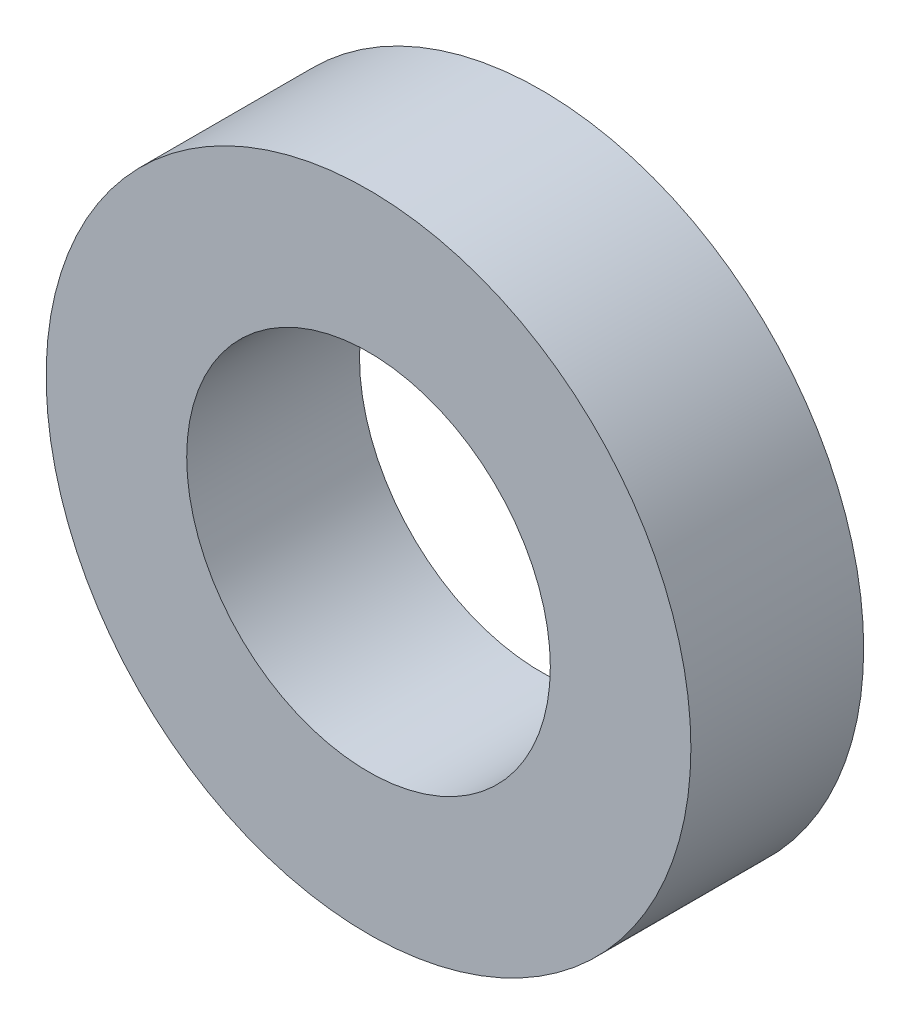
ISO-10303-21;
HEADER;
FILE_DESCRIPTION(('STEP AP214'),'2;1');
FILE_NAME('part.step','',(''),(''),'','','');
FILE_SCHEMA(('AUTOMOTIVE_DESIGN { 1 0 10303 214 1 1 1 1 }'));
ENDSEC;
DATA;
#1=APPLICATION_CONTEXT('core data for automotive mechanical design processes');
#2=APPLICATION_PROTOCOL_DEFINITION('international standard','automotive_design',2000,#1);
#3=PRODUCT_CONTEXT('',#1,'mechanical');
#4=PRODUCT('Part','Part','',(#3));
#5=PRODUCT_RELATED_PRODUCT_CATEGORY('part','',(#4));
#6=PRODUCT_DEFINITION_FORMATION('','',#4);
#7=PRODUCT_DEFINITION_CONTEXT('part definition',#1,'design');
#8=PRODUCT_DEFINITION('design','',#6,#7);
#9=PRODUCT_DEFINITION_SHAPE('','',#8);
#10=(LENGTH_UNIT() NAMED_UNIT(*) SI_UNIT(.MILLI.,.METRE.));
#11=(NAMED_UNIT(*) PLANE_ANGLE_UNIT() SI_UNIT($,.RADIAN.));
#12=(NAMED_UNIT(*) SI_UNIT($,.STERADIAN.) SOLID_ANGLE_UNIT());
#13=UNCERTAINTY_MEASURE_WITH_UNIT(LENGTH_MEASURE(1.E-05),#10,'distance_accuracy_value','');
#14=(GEOMETRIC_REPRESENTATION_CONTEXT(3) GLOBAL_UNCERTAINTY_ASSIGNED_CONTEXT((#13)) GLOBAL_UNIT_ASSIGNED_CONTEXT((#10,
#11,#12)) REPRESENTATION_CONTEXT('',''));
#15=CARTESIAN_POINT('',(0.,0.,0.));
#16=DIRECTION('',(0.,0.,1.));
#17=DIRECTION('',(1.,0.,0.));
#18=AXIS2_PLACEMENT_3D('',#15,#16,#17);
#19=CARTESIAN_POINT('',(0.,0.,-1.7018));
#20=DIRECTION('',(0.,0.,1.));
#21=DIRECTION('',(1.,0.,0.));
#22=AXIS2_PLACEMENT_3D('',#19,#20,#21);
#23=CYLINDRICAL_SURFACE('',#22,3.175);
#24=CARTESIAN_POINT('',(0.,0.,-1.7018));
#25=DIRECTION('',(0.,0.,1.));
#26=DIRECTION('',(1.,0.,0.));
#27=AXIS2_PLACEMENT_3D('',#24,#25,#26);
#28=CIRCLE('',#27,3.175);
#29=CARTESIAN_POINT('',(3.175,0.,-1.7018));
#30=VERTEX_POINT('',#29);
#31=EDGE_CURVE('E10',#30,#30,#28,.T.);
#32=ORIENTED_EDGE('',*,*,#31,.T.);
#33=EDGE_LOOP('',(#32));
#34=FACE_BOUND('',#33,.T.);
#35=CARTESIAN_POINT('',(0.,0.,0.));
#36=DIRECTION('',(0.,0.,1.));
#37=DIRECTION('',(1.,0.,0.));
#38=AXIS2_PLACEMENT_3D('',#35,#36,#37);
#39=CIRCLE('',#38,3.175);
#40=CARTESIAN_POINT('',(3.175,0.,0.));
#41=VERTEX_POINT('',#40);
#42=EDGE_CURVE('E35',#41,#41,#39,.T.);
#43=ORIENTED_EDGE('',*,*,#42,.F.);
#44=EDGE_LOOP('',(#43));
#45=FACE_BOUND('',#44,.T.);
#46=ADVANCED_FACE('F32',(#34,#45),#23,.T.);
#47=CARTESIAN_POINT('',(0.,0.,-1.7018));
#48=DIRECTION('',(0.,0.,1.));
#49=DIRECTION('',(1.,0.,0.));
#50=AXIS2_PLACEMENT_3D('',#47,#48,#49);
#51=PLANE('',#50);
#52=CARTESIAN_POINT('',(0.,0.,-1.7018));
#53=DIRECTION('',(0.,0.,1.));
#54=DIRECTION('',(1.,0.,0.));
#55=AXIS2_PLACEMENT_3D('',#52,#53,#54);
#56=CIRCLE('',#55,1.7907);
#57=CARTESIAN_POINT('',(1.7907,0.,-1.7018));
#58=VERTEX_POINT('',#57);
#59=EDGE_CURVE('E42',#58,#58,#56,.T.);
#60=ORIENTED_EDGE('',*,*,#59,.T.);
#61=EDGE_LOOP('',(#60));
#62=FACE_BOUND('',#61,.T.);
#63=ORIENTED_EDGE('',*,*,#31,.F.);
#64=EDGE_LOOP('',(#63));
#65=FACE_BOUND('',#64,.T.);
#66=ADVANCED_FACE('F50',(#62,#65),#51,.F.);
#67=CARTESIAN_POINT('',(0.,0.,0.));
#68=DIRECTION('',(0.,0.,1.));
#69=DIRECTION('',(1.,0.,0.));
#70=AXIS2_PLACEMENT_3D('',#67,#68,#69);
#71=PLANE('',#70);
#72=CARTESIAN_POINT('',(0.,0.,0.));
#73=DIRECTION('',(0.,0.,1.));
#74=DIRECTION('',(1.,0.,0.));
#75=AXIS2_PLACEMENT_3D('',#72,#73,#74);
#76=CIRCLE('',#75,1.7907);
#77=CARTESIAN_POINT('',(1.7907,0.,0.));
#78=VERTEX_POINT('',#77);
#79=EDGE_CURVE('E44',#78,#78,#76,.T.);
#80=ORIENTED_EDGE('',*,*,#79,.F.);
#81=EDGE_LOOP('',(#80));
#82=FACE_BOUND('',#81,.T.);
#83=ORIENTED_EDGE('',*,*,#42,.T.);
#84=EDGE_LOOP('',(#83));
#85=FACE_BOUND('',#84,.T.);
#86=ADVANCED_FACE('F56',(#82,#85),#71,.T.);
#87=CARTESIAN_POINT('',(0.,0.,-1.7018));
#88=DIRECTION('',(0.,0.,1.));
#89=DIRECTION('',(1.,0.,0.));
#90=AXIS2_PLACEMENT_3D('',#87,#88,#89);
#91=CYLINDRICAL_SURFACE('',#90,1.7907);
#92=ORIENTED_EDGE('',*,*,#59,.F.);
#93=EDGE_LOOP('',(#92));
#94=FACE_BOUND('',#93,.T.);
#95=ORIENTED_EDGE('',*,*,#79,.T.);
#96=EDGE_LOOP('',(#95));
#97=FACE_BOUND('',#96,.T.);
#98=ADVANCED_FACE('F53',(#94,#97),#91,.F.);
#99=CLOSED_SHELL('',(#46,#66,#86,#98));
#100=MANIFOLD_SOLID_BREP('B2',#99);
#101=ADVANCED_BREP_SHAPE_REPRESENTATION('',(#18,#100),#14);
#102=SHAPE_DEFINITION_REPRESENTATION(#9,#101);
ENDSEC;
END-ISO-10303-21;
